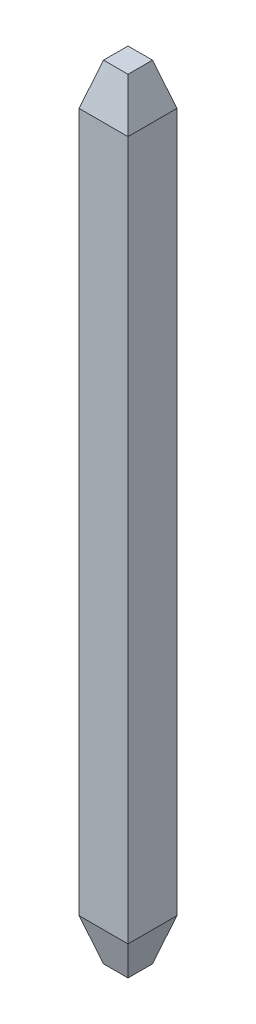
ISO-10303-21;
HEADER;
FILE_DESCRIPTION(('STEP AP214'),'2;1');
FILE_NAME('part.step','',(''),(''),'','','');
FILE_SCHEMA(('AUTOMOTIVE_DESIGN { 1 0 10303 214 1 1 1 1 }'));
ENDSEC;
DATA;
#1=APPLICATION_CONTEXT('core data for automotive mechanical design processes');
#2=APPLICATION_PROTOCOL_DEFINITION('international standard','automotive_design',2000,#1);
#3=PRODUCT_CONTEXT('',#1,'mechanical');
#4=PRODUCT('Part','Part','',(#3));
#5=PRODUCT_RELATED_PRODUCT_CATEGORY('part','',(#4));
#6=PRODUCT_DEFINITION_FORMATION('','',#4);
#7=PRODUCT_DEFINITION_CONTEXT('part definition',#1,'design');
#8=PRODUCT_DEFINITION('design','',#6,#7);
#9=PRODUCT_DEFINITION_SHAPE('','',#8);
#10=(LENGTH_UNIT() NAMED_UNIT(*) SI_UNIT(.MILLI.,.METRE.));
#11=(NAMED_UNIT(*) PLANE_ANGLE_UNIT() SI_UNIT($,.RADIAN.));
#12=(NAMED_UNIT(*) SI_UNIT($,.STERADIAN.) SOLID_ANGLE_UNIT());
#13=UNCERTAINTY_MEASURE_WITH_UNIT(LENGTH_MEASURE(1.E-05),#10,'distance_accuracy_value','');
#14=(GEOMETRIC_REPRESENTATION_CONTEXT(3) GLOBAL_UNCERTAINTY_ASSIGNED_CONTEXT((#13)) GLOBAL_UNIT_ASSIGNED_CONTEXT((#10,
#11,#12)) REPRESENTATION_CONTEXT('',''));
#15=CARTESIAN_POINT('',(0.,0.,0.));
#16=DIRECTION('',(0.,0.,1.));
#17=DIRECTION('',(1.,0.,0.));
#18=AXIS2_PLACEMENT_3D('',#15,#16,#17);
#19=CARTESIAN_POINT('',(11.5900000000129,-0.965870106912629,-17.2999999999763));
#20=DIRECTION('',(0.,0.281214622974643,-0.959644900900968));
#21=DIRECTION('',(-1.,0.,0.));
#22=AXIS2_PLACEMENT_3D('',#19,#20,#21);
#23=PLANE('',#22);
#24=DIRECTION('',(0.270714017147727,0.923811583516618,0.270714017147727));
#25=VECTOR('',#24,1.);
#26=CARTESIAN_POINT('',(11.2700000000129,-0.965870106912629,-17.2999999999763));
#27=LINE('',#26,#25);
#28=CARTESIAN_POINT('',(11.2700000000129,-0.965870106912631,-17.2999999999763));
#29=VERTEX_POINT('',#28);
#30=CARTESIAN_POINT('',(11.4300000000129,-0.419870106912631,-17.1399999999763));
#31=VERTEX_POINT('',#30);
#32=EDGE_CURVE('E11',#29,#31,#27,.T.);
#33=ORIENTED_EDGE('',*,*,#32,.T.);
#34=DIRECTION('',(1.,0.,0.));
#35=VECTOR('',#34,1.);
#36=CARTESIAN_POINT('',(11.4300000000129,-0.419870106912629,-17.1399999999763));
#37=LINE('',#36,#35);
#38=CARTESIAN_POINT('',(11.7500000000129,-0.419870106912631,-17.1399999999763));
#39=VERTEX_POINT('',#38);
#40=EDGE_CURVE('E28',#31,#39,#37,.T.);
#41=ORIENTED_EDGE('',*,*,#40,.T.);
#42=DIRECTION('',(-0.270714017147727,0.923811583516618,0.270714017147727));
#43=VECTOR('',#42,1.);
#44=CARTESIAN_POINT('',(11.9100000000129,-0.965870106912629,-17.2999999999763));
#45=LINE('',#44,#43);
#46=CARTESIAN_POINT('',(11.9100000000129,-0.965870106912631,-17.2999999999763));
#47=VERTEX_POINT('',#46);
#48=EDGE_CURVE('E224',#47,#39,#45,.T.);
#49=ORIENTED_EDGE('',*,*,#48,.F.);
#50=DIRECTION('',(1.,0.,0.));
#51=VECTOR('',#50,1.);
#52=CARTESIAN_POINT('',(11.2700000000129,-0.965870106912629,-17.2999999999763));
#53=LINE('',#52,#51);
#54=EDGE_CURVE('E218',#29,#47,#53,.T.);
#55=ORIENTED_EDGE('',*,*,#54,.F.);
#56=EDGE_LOOP('',(#33,#41,#49,#55));
#57=FACE_BOUND('',#56,.T.);
#58=ADVANCED_FACE('F17',(#57),#23,.T.);
#59=CARTESIAN_POINT('',(11.2700000000129,-0.965870106912629,-16.9799999999763));
#60=DIRECTION('',(-0.959644900900968,0.281214622974643,0.));
#61=DIRECTION('',(0.,0.,1.));
#62=AXIS2_PLACEMENT_3D('',#59,#60,#61);
#63=PLANE('',#62);
#64=DIRECTION('',(0.270714017147727,0.923811583516618,-0.270714017147727));
#65=VECTOR('',#64,1.);
#66=CARTESIAN_POINT('',(11.2700000000129,-0.965870106912629,-16.6599999999763));
#67=LINE('',#66,#65);
#68=CARTESIAN_POINT('',(11.2700000000129,-0.965870106912631,-16.6599999999763));
#69=VERTEX_POINT('',#68);
#70=CARTESIAN_POINT('',(11.4300000000129,-0.419870106912631,-16.8199999999763));
#71=VERTEX_POINT('',#70);
#72=EDGE_CURVE('E101',#69,#71,#67,.T.);
#73=ORIENTED_EDGE('',*,*,#72,.T.);
#74=DIRECTION('',(0.,0.,-1.));
#75=VECTOR('',#74,1.);
#76=CARTESIAN_POINT('',(11.4300000000129,-0.419870106912629,-16.8199999999763));
#77=LINE('',#76,#75);
#78=EDGE_CURVE('E126',#71,#31,#77,.T.);
#79=ORIENTED_EDGE('',*,*,#78,.T.);
#80=ORIENTED_EDGE('',*,*,#32,.F.);
#81=DIRECTION('',(0.,0.,-1.));
#82=VECTOR('',#81,1.);
#83=CARTESIAN_POINT('',(11.2700000000129,-0.965870106912629,-16.6599999999763));
#84=LINE('',#83,#82);
#85=EDGE_CURVE('E175',#69,#29,#84,.T.);
#86=ORIENTED_EDGE('',*,*,#85,.F.);
#87=EDGE_LOOP('',(#73,#79,#80,#86));
#88=FACE_BOUND('',#87,.T.);
#89=ADVANCED_FACE('F244',(#88),#63,.T.);
#90=CARTESIAN_POINT('',(11.5900000000129,-0.965870106912629,-16.6599999999763));
#91=DIRECTION('',(0.,0.281214622974643,0.959644900900968));
#92=DIRECTION('',(1.,0.,0.));
#93=AXIS2_PLACEMENT_3D('',#90,#91,#92);
#94=PLANE('',#93);
#95=DIRECTION('',(-0.270714017147727,0.923811583516618,-0.270714017147727));
#96=VECTOR('',#95,1.);
#97=CARTESIAN_POINT('',(11.9100000000129,-0.965870106912629,-16.6599999999763));
#98=LINE('',#97,#96);
#99=CARTESIAN_POINT('',(11.9100000000129,-0.965870106912631,-16.6599999999763));
#100=VERTEX_POINT('',#99);
#101=CARTESIAN_POINT('',(11.7500000000129,-0.419870106912631,-16.8199999999763));
#102=VERTEX_POINT('',#101);
#103=EDGE_CURVE('E98',#100,#102,#98,.T.);
#104=ORIENTED_EDGE('',*,*,#103,.T.);
#105=DIRECTION('',(-1.,0.,0.));
#106=VECTOR('',#105,1.);
#107=CARTESIAN_POINT('',(11.7500000000129,-0.419870106912629,-16.8199999999763));
#108=LINE('',#107,#106);
#109=EDGE_CURVE('E118',#102,#71,#108,.T.);
#110=ORIENTED_EDGE('',*,*,#109,.T.);
#111=ORIENTED_EDGE('',*,*,#72,.F.);
#112=DIRECTION('',(-1.,0.,0.));
#113=VECTOR('',#112,1.);
#114=CARTESIAN_POINT('',(11.9100000000129,-0.965870106912629,-16.6599999999763));
#115=LINE('',#114,#113);
#116=EDGE_CURVE('E93',#100,#69,#115,.T.);
#117=ORIENTED_EDGE('',*,*,#116,.F.);
#118=EDGE_LOOP('',(#104,#110,#111,#117));
#119=FACE_BOUND('',#118,.T.);
#120=ADVANCED_FACE('F95',(#119),#94,.T.);
#121=CARTESIAN_POINT('',(11.269000000013,-5.53543505344787,-16.6599999999763));
#122=DIRECTION('',(0.,0.,1.));
#123=DIRECTION('',(1.,0.,0.));
#124=AXIS2_PLACEMENT_3D('',#121,#122,#123);
#125=PLANE('',#124);
#126=DIRECTION('',(0.,1.,0.));
#127=VECTOR('',#126,1.);
#128=CARTESIAN_POINT('',(11.2700000000129,-10.1039999999831,-16.6599999999763));
#129=LINE('',#128,#127);
#130=CARTESIAN_POINT('',(11.2700000000129,-10.1039999999831,-16.6599999999763));
#131=VERTEX_POINT('',#130);
#132=EDGE_CURVE('E172',#131,#69,#129,.T.);
#133=ORIENTED_EDGE('',*,*,#132,.F.);
#134=DIRECTION('',(-1.,0.,0.));
#135=VECTOR('',#134,1.);
#136=CARTESIAN_POINT('',(11.9100000000129,-10.1039999999831,-16.6599999999763));
#137=LINE('',#136,#135);
#138=CARTESIAN_POINT('',(11.9100000000129,-10.1039999999831,-16.6599999999763));
#139=VERTEX_POINT('',#138);
#140=EDGE_CURVE('E111',#139,#131,#137,.T.);
#141=ORIENTED_EDGE('',*,*,#140,.F.);
#142=DIRECTION('',(0.,1.,0.));
#143=VECTOR('',#142,1.);
#144=CARTESIAN_POINT('',(11.9100000000129,-10.1039999999831,-16.6599999999763));
#145=LINE('',#144,#143);
#146=EDGE_CURVE('E105',#139,#100,#145,.T.);
#147=ORIENTED_EDGE('',*,*,#146,.T.);
#148=ORIENTED_EDGE('',*,*,#116,.T.);
#149=EDGE_LOOP('',(#133,#141,#147,#148));
#150=FACE_BOUND('',#149,.T.);
#151=ADVANCED_FACE('F109',(#150),#125,.T.);
#152=CARTESIAN_POINT('',(11.9100000000129,-11.0738701069126,-16.9799999999763));
#153=DIRECTION('',(1.,0.,0.));
#154=DIRECTION('',(0.,1.,0.));
#155=AXIS2_PLACEMENT_3D('',#152,#153,#154);
#156=PLANE('',#155);
#157=ORIENTED_EDGE('',*,*,#146,.F.);
#158=DIRECTION('',(0.,0.,1.));
#159=VECTOR('',#158,1.);
#160=CARTESIAN_POINT('',(11.9100000000129,-10.1039999999831,-17.2999999999763));
#161=LINE('',#160,#159);
#162=CARTESIAN_POINT('',(11.9100000000129,-10.1039999999831,-17.2999999999763));
#163=VERTEX_POINT('',#162);
#164=EDGE_CURVE('E21',#163,#139,#161,.T.);
#165=ORIENTED_EDGE('',*,*,#164,.F.);
#166=DIRECTION('',(0.,1.,0.));
#167=VECTOR('',#166,1.);
#168=CARTESIAN_POINT('',(11.9100000000129,-10.1039999999831,-17.2999999999763));
#169=LINE('',#168,#167);
#170=EDGE_CURVE('E106',#163,#47,#169,.T.);
#171=ORIENTED_EDGE('',*,*,#170,.T.);
#172=DIRECTION('',(0.,0.,1.));
#173=VECTOR('',#172,1.);
#174=CARTESIAN_POINT('',(11.9100000000129,-0.965870106912629,-17.2999999999763));
#175=LINE('',#174,#173);
#176=EDGE_CURVE('E123',#47,#100,#175,.T.);
#177=ORIENTED_EDGE('',*,*,#176,.T.);
#178=EDGE_LOOP('',(#157,#165,#171,#177));
#179=FACE_BOUND('',#178,.T.);
#180=ADVANCED_FACE('F19',(#179),#156,.T.);
#181=CARTESIAN_POINT('',(11.9100000000129,-10.1039999999831,-16.9799999999763));
#182=DIRECTION('',(0.959644900900968,-0.281214622974644,0.));
#183=DIRECTION('',(0.,0.,-1.));
#184=AXIS2_PLACEMENT_3D('',#181,#182,#183);
#185=PLANE('',#184);
#186=ORIENTED_EDGE('',*,*,#164,.T.);
#187=DIRECTION('',(-0.270714017147728,-0.923811583516617,-0.270714017147728));
#188=VECTOR('',#187,1.);
#189=CARTESIAN_POINT('',(11.9100000000129,-10.1039999999831,-16.6599999999763));
#190=LINE('',#189,#188);
#191=CARTESIAN_POINT('',(11.7500000000129,-10.6499999999831,-16.8199999999763));
#192=VERTEX_POINT('',#191);
#193=EDGE_CURVE('E138',#139,#192,#190,.T.);
#194=ORIENTED_EDGE('',*,*,#193,.T.);
#195=DIRECTION('',(0.,0.,1.));
#196=VECTOR('',#195,1.);
#197=CARTESIAN_POINT('',(11.7500000000129,-10.6499999999831,-17.1399999999763));
#198=LINE('',#197,#196);
#199=CARTESIAN_POINT('',(11.7500000000129,-10.6499999999831,-17.1399999999763));
#200=VERTEX_POINT('',#199);
#201=EDGE_CURVE('E149',#200,#192,#198,.T.);
#202=ORIENTED_EDGE('',*,*,#201,.F.);
#203=DIRECTION('',(-0.270714017147728,-0.923811583516617,0.270714017147728));
#204=VECTOR('',#203,1.);
#205=CARTESIAN_POINT('',(11.9100000000129,-10.1039999999831,-17.2999999999763));
#206=LINE('',#205,#204);
#207=EDGE_CURVE('E144',#163,#200,#206,.T.);
#208=ORIENTED_EDGE('',*,*,#207,.F.);
#209=EDGE_LOOP('',(#186,#194,#202,#208));
#210=FACE_BOUND('',#209,.T.);
#211=ADVANCED_FACE('F203',(#210),#185,.T.);
#212=CARTESIAN_POINT('',(11.5900000000129,-10.1039999999831,-17.2999999999763));
#213=DIRECTION('',(0.,-0.281214622974644,-0.959644900900968));
#214=DIRECTION('',(0.,-0.959644900900968,0.281214622974644));
#215=AXIS2_PLACEMENT_3D('',#212,#213,#214);
#216=PLANE('',#215);
#217=DIRECTION('',(1.,0.,0.));
#218=VECTOR('',#217,1.);
#219=CARTESIAN_POINT('',(11.2700000000129,-10.1039999999831,-17.2999999999763));
#220=LINE('',#219,#218);
#221=CARTESIAN_POINT('',(11.2700000000129,-10.1039999999831,-17.2999999999763));
#222=VERTEX_POINT('',#221);
#223=EDGE_CURVE('E181',#222,#163,#220,.T.);
#224=ORIENTED_EDGE('',*,*,#223,.T.);
#225=ORIENTED_EDGE('',*,*,#207,.T.);
#226=DIRECTION('',(1.,0.,0.));
#227=VECTOR('',#226,1.);
#228=CARTESIAN_POINT('',(11.4300000000129,-10.6499999999831,-17.1399999999763));
#229=LINE('',#228,#227);
#230=CARTESIAN_POINT('',(11.4300000000129,-10.6499999999831,-17.1399999999763));
#231=VERTEX_POINT('',#230);
#232=EDGE_CURVE('E160',#231,#200,#229,.T.);
#233=ORIENTED_EDGE('',*,*,#232,.F.);
#234=DIRECTION('',(0.270714017147728,-0.923811583516617,0.270714017147728));
#235=VECTOR('',#234,1.);
#236=CARTESIAN_POINT('',(11.2700000000129,-10.1039999999831,-17.2999999999763));
#237=LINE('',#236,#235);
#238=EDGE_CURVE('E145',#222,#231,#237,.T.);
#239=ORIENTED_EDGE('',*,*,#238,.F.);
#240=EDGE_LOOP('',(#224,#225,#233,#239));
#241=FACE_BOUND('',#240,.T.);
#242=ADVANCED_FACE('F196',(#241),#216,.T.);
#243=CARTESIAN_POINT('',(11.2700000000129,-10.1039999999831,-16.9799999999763));
#244=DIRECTION('',(-0.959644900900968,-0.281214622974644,0.));
#245=DIRECTION('',(-0.281214622974644,0.959644900900968,0.));
#246=AXIS2_PLACEMENT_3D('',#243,#244,#245);
#247=PLANE('',#246);
#248=DIRECTION('',(0.,0.,-1.));
#249=VECTOR('',#248,1.);
#250=CARTESIAN_POINT('',(11.2700000000129,-10.1039999999831,-16.6599999999763));
#251=LINE('',#250,#249);
#252=EDGE_CURVE('E141',#131,#222,#251,.T.);
#253=ORIENTED_EDGE('',*,*,#252,.T.);
#254=ORIENTED_EDGE('',*,*,#238,.T.);
#255=DIRECTION('',(0.,0.,-1.));
#256=VECTOR('',#255,1.);
#257=CARTESIAN_POINT('',(11.4300000000129,-10.6499999999831,-16.8199999999763));
#258=LINE('',#257,#256);
#259=CARTESIAN_POINT('',(11.4300000000129,-10.6499999999831,-16.8199999999763));
#260=VERTEX_POINT('',#259);
#261=EDGE_CURVE('E150',#260,#231,#258,.T.);
#262=ORIENTED_EDGE('',*,*,#261,.F.);
#263=DIRECTION('',(0.270714017147728,-0.923811583516617,-0.270714017147728));
#264=VECTOR('',#263,1.);
#265=CARTESIAN_POINT('',(11.2700000000129,-10.1039999999831,-16.6599999999763));
#266=LINE('',#265,#264);
#267=EDGE_CURVE('E174',#131,#260,#266,.T.);
#268=ORIENTED_EDGE('',*,*,#267,.F.);
#269=EDGE_LOOP('',(#253,#254,#262,#268));
#270=FACE_BOUND('',#269,.T.);
#271=ADVANCED_FACE('F190',(#270),#247,.T.);
#272=CARTESIAN_POINT('',(11.4290000000129,-10.6499999999831,-16.9799999999763));
#273=DIRECTION('',(0.,-1.,0.));
#274=DIRECTION('',(0.,0.,-1.));
#275=AXIS2_PLACEMENT_3D('',#272,#273,#274);
#276=PLANE('',#275);
#277=ORIENTED_EDGE('',*,*,#201,.T.);
#278=DIRECTION('',(-1.,0.,0.));
#279=VECTOR('',#278,1.);
#280=CARTESIAN_POINT('',(11.7500000000129,-10.6499999999831,-16.8199999999763));
#281=LINE('',#280,#279);
#282=EDGE_CURVE('E146',#192,#260,#281,.T.);
#283=ORIENTED_EDGE('',*,*,#282,.T.);
#284=ORIENTED_EDGE('',*,*,#261,.T.);
#285=ORIENTED_EDGE('',*,*,#232,.T.);
#286=EDGE_LOOP('',(#277,#283,#284,#285));
#287=FACE_BOUND('',#286,.T.);
#288=ADVANCED_FACE('F198',(#287),#276,.T.);
#289=CARTESIAN_POINT('',(11.5900000000129,-10.1039999999831,-16.6599999999763));
#290=DIRECTION('',(0.,-0.281214622974644,0.959644900900968));
#291=DIRECTION('',(-1.,0.,0.));
#292=AXIS2_PLACEMENT_3D('',#289,#290,#291);
#293=PLANE('',#292);
#294=ORIENTED_EDGE('',*,*,#140,.T.);
#295=ORIENTED_EDGE('',*,*,#267,.T.);
#296=ORIENTED_EDGE('',*,*,#282,.F.);
#297=ORIENTED_EDGE('',*,*,#193,.F.);
#298=EDGE_LOOP('',(#294,#295,#296,#297));
#299=FACE_BOUND('',#298,.T.);
#300=ADVANCED_FACE('F207',(#299),#293,.T.);
#301=CARTESIAN_POINT('',(11.2700000000129,-5.53543505344786,-16.6589999999763));
#302=DIRECTION('',(-1.,0.,0.));
#303=DIRECTION('',(0.,0.,1.));
#304=AXIS2_PLACEMENT_3D('',#301,#302,#303);
#305=PLANE('',#304);
#306=DIRECTION('',(0.,1.,0.));
#307=VECTOR('',#306,1.);
#308=CARTESIAN_POINT('',(11.2700000000129,-10.1039999999831,-17.2999999999763));
#309=LINE('',#308,#307);
#310=EDGE_CURVE('E170',#222,#29,#309,.T.);
#311=ORIENTED_EDGE('',*,*,#310,.F.);
#312=ORIENTED_EDGE('',*,*,#252,.F.);
#313=ORIENTED_EDGE('',*,*,#132,.T.);
#314=ORIENTED_EDGE('',*,*,#85,.T.);
#315=EDGE_LOOP('',(#311,#312,#313,#314));
#316=FACE_BOUND('',#315,.T.);
#317=ADVANCED_FACE('F210',(#316),#305,.T.);
#318=CARTESIAN_POINT('',(11.9110000000129,-5.53443505344787,-17.2999999999763));
#319=DIRECTION('',(0.,0.,-1.));
#320=DIRECTION('',(0.,-1.,0.));
#321=AXIS2_PLACEMENT_3D('',#318,#319,#320);
#322=PLANE('',#321);
#323=ORIENTED_EDGE('',*,*,#170,.F.);
#324=ORIENTED_EDGE('',*,*,#223,.F.);
#325=ORIENTED_EDGE('',*,*,#310,.T.);
#326=ORIENTED_EDGE('',*,*,#54,.T.);
#327=EDGE_LOOP('',(#323,#324,#325,#326));
#328=FACE_BOUND('',#327,.T.);
#329=ADVANCED_FACE('F265',(#328),#322,.T.);
#330=CARTESIAN_POINT('',(11.9100000000129,-0.965870106912629,-16.9799999999763));
#331=DIRECTION('',(0.959644900900968,0.281214622974643,0.));
#332=DIRECTION('',(0.,0.,-1.));
#333=AXIS2_PLACEMENT_3D('',#330,#331,#332);
#334=PLANE('',#333);
#335=ORIENTED_EDGE('',*,*,#48,.T.);
#336=DIRECTION('',(0.,0.,1.));
#337=VECTOR('',#336,1.);
#338=CARTESIAN_POINT('',(11.7500000000129,-0.419870106912629,-17.1399999999763));
#339=LINE('',#338,#337);
#340=EDGE_CURVE('E124',#39,#102,#339,.T.);
#341=ORIENTED_EDGE('',*,*,#340,.T.);
#342=ORIENTED_EDGE('',*,*,#103,.F.);
#343=ORIENTED_EDGE('',*,*,#176,.F.);
#344=EDGE_LOOP('',(#335,#341,#342,#343));
#345=FACE_BOUND('',#344,.T.);
#346=ADVANCED_FACE('F122',(#345),#334,.T.);
#347=CARTESIAN_POINT('',(11.5900000000129,-0.419870106912629,-17.1409999999763));
#348=DIRECTION('',(0.,1.,0.));
#349=DIRECTION('',(1.,0.,0.));
#350=AXIS2_PLACEMENT_3D('',#347,#348,#349);
#351=PLANE('',#350);
#352=ORIENTED_EDGE('',*,*,#40,.F.);
#353=ORIENTED_EDGE('',*,*,#78,.F.);
#354=ORIENTED_EDGE('',*,*,#109,.F.);
#355=ORIENTED_EDGE('',*,*,#340,.F.);
#356=EDGE_LOOP('',(#352,#353,#354,#355));
#357=FACE_BOUND('',#356,.T.);
#358=ADVANCED_FACE('F242',(#357),#351,.T.);
#359=CLOSED_SHELL('',(#58,#89,#120,#151,#180,#211,#242,#271,#288,#300,#317,#329,#346,#358));
#360=MANIFOLD_SOLID_BREP('B1',#359);
#361=ADVANCED_BREP_SHAPE_REPRESENTATION('',(#18,#360),#14);
#362=SHAPE_DEFINITION_REPRESENTATION(#9,#361);
ENDSEC;
END-ISO-10303-21;
